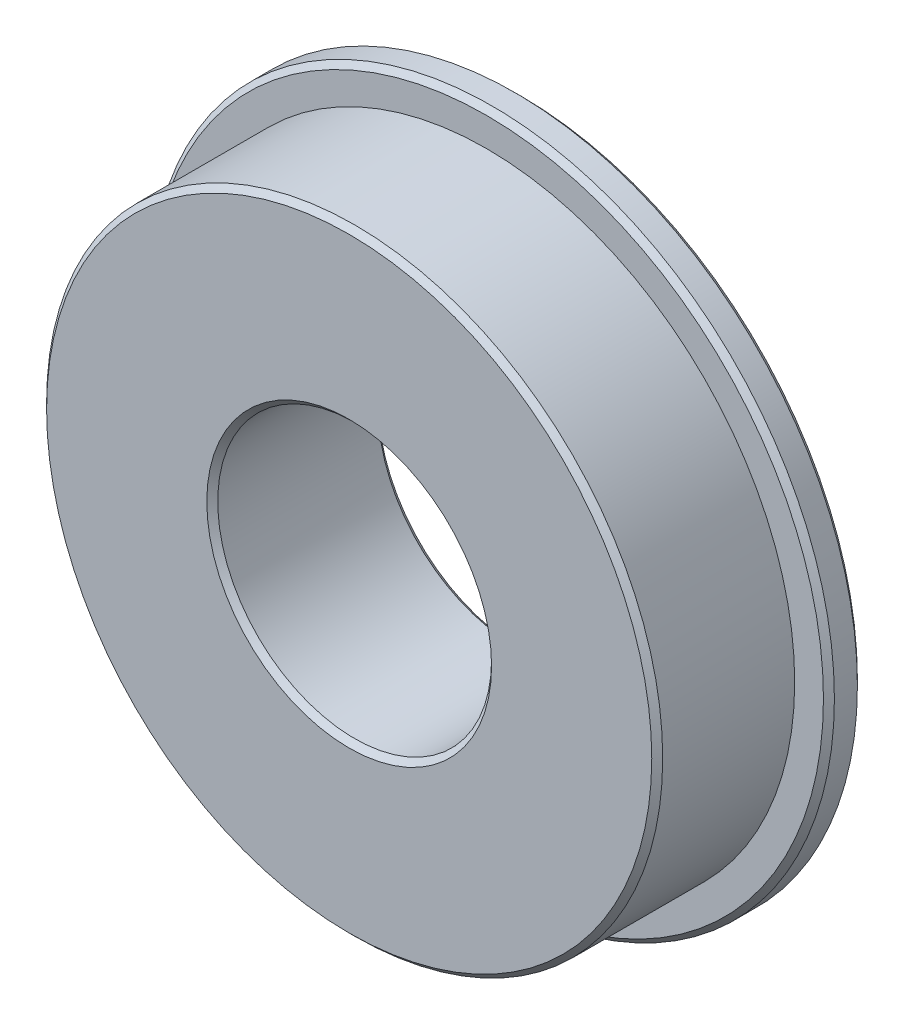
ISO-10303-21;
HEADER;
FILE_DESCRIPTION(('STEP AP214'),'2;1');
FILE_NAME('part.step','',(''),(''),'','','');
FILE_SCHEMA(('AUTOMOTIVE_DESIGN { 1 0 10303 214 1 1 1 1 }'));
ENDSEC;
DATA;
#1=APPLICATION_CONTEXT('core data for automotive mechanical design processes');
#2=APPLICATION_PROTOCOL_DEFINITION('international standard','automotive_design',2000,#1);
#3=PRODUCT_CONTEXT('',#1,'mechanical');
#4=PRODUCT('Part','Part','',(#3));
#5=PRODUCT_RELATED_PRODUCT_CATEGORY('part','',(#4));
#6=PRODUCT_DEFINITION_FORMATION('','',#4);
#7=PRODUCT_DEFINITION_CONTEXT('part definition',#1,'design');
#8=PRODUCT_DEFINITION('design','',#6,#7);
#9=PRODUCT_DEFINITION_SHAPE('','',#8);
#10=(LENGTH_UNIT() NAMED_UNIT(*) SI_UNIT(.MILLI.,.METRE.));
#11=(NAMED_UNIT(*) PLANE_ANGLE_UNIT() SI_UNIT($,.RADIAN.));
#12=(NAMED_UNIT(*) SI_UNIT($,.STERADIAN.) SOLID_ANGLE_UNIT());
#13=UNCERTAINTY_MEASURE_WITH_UNIT(LENGTH_MEASURE(1.E-05),#10,'distance_accuracy_value','');
#14=(GEOMETRIC_REPRESENTATION_CONTEXT(3) GLOBAL_UNCERTAINTY_ASSIGNED_CONTEXT((#13)) GLOBAL_UNIT_ASSIGNED_CONTEXT((#10,
#11,#12)) REPRESENTATION_CONTEXT('',''));
#15=CARTESIAN_POINT('',(0.,0.,0.));
#16=DIRECTION('',(0.,0.,1.));
#17=DIRECTION('',(1.,0.,0.));
#18=AXIS2_PLACEMENT_3D('',#15,#16,#17);
#19=CARTESIAN_POINT('',(-8.86153846153846,6.04195804195805,7.69619999999998));
#20=DIRECTION('',(0.,0.,-1.));
#21=DIRECTION('',(-1.,0.,0.));
#22=AXIS2_PLACEMENT_3D('',#19,#20,#21);
#23=CONICAL_SURFACE('',#22,14.2875,0.785398163397453);
#24=CARTESIAN_POINT('',(-8.86153846153846,6.04195804195805,7.95019999999999));
#25=DIRECTION('',(0.,0.,-1.));
#26=DIRECTION('',(-1.,0.,0.));
#27=AXIS2_PLACEMENT_3D('',#24,#25,#26);
#28=CIRCLE('',#27,14.0335);
#29=CARTESIAN_POINT('',(-22.8950384615385,6.04195804195805,7.95019999999999));
#30=VERTEX_POINT('',#29);
#31=EDGE_CURVE('E17',#30,#30,#28,.T.);
#32=ORIENTED_EDGE('',*,*,#31,.T.);
#33=EDGE_LOOP('',(#32));
#34=FACE_BOUND('',#33,.T.);
#35=CARTESIAN_POINT('',(-8.86153846153846,6.04195804195805,7.69619999999999));
#36=DIRECTION('',(0.,0.,1.));
#37=DIRECTION('',(1.,0.,0.));
#38=AXIS2_PLACEMENT_3D('',#35,#36,#37);
#39=CIRCLE('',#38,14.2875);
#40=CARTESIAN_POINT('',(5.42596153846154,6.04195804195805,7.69619999999999));
#41=VERTEX_POINT('',#40);
#42=EDGE_CURVE('E29',#41,#41,#39,.F.);
#43=ORIENTED_EDGE('',*,*,#42,.F.);
#44=EDGE_LOOP('',(#43));
#45=FACE_BOUND('',#44,.T.);
#46=ADVANCED_FACE('F14',(#34,#45),#23,.T.);
#47=CARTESIAN_POINT('',(-8.86153846153846,6.04195804195805,7.95019999999999));
#48=DIRECTION('',(0.,0.,1.));
#49=DIRECTION('',(1.,0.,0.));
#50=AXIS2_PLACEMENT_3D('',#47,#48,#49);
#51=CYLINDRICAL_SURFACE('',#50,14.2875);
#52=CARTESIAN_POINT('',(-8.86153846153846,6.04195804195805,1.57479999999999));
#53=DIRECTION('',(0.,0.,1.));
#54=DIRECTION('',(1.,0.,0.));
#55=AXIS2_PLACEMENT_3D('',#52,#53,#54);
#56=CIRCLE('',#55,14.2875);
#57=CARTESIAN_POINT('',(5.42596153846154,6.04195804195805,1.57479999999999));
#58=VERTEX_POINT('',#57);
#59=EDGE_CURVE('E38',#58,#58,#56,.T.);
#60=ORIENTED_EDGE('',*,*,#59,.T.);
#61=EDGE_LOOP('',(#60));
#62=FACE_BOUND('',#61,.T.);
#63=ORIENTED_EDGE('',*,*,#42,.T.);
#64=EDGE_LOOP('',(#63));
#65=FACE_BOUND('',#64,.T.);
#66=ADVANCED_FACE('F48',(#62,#65),#51,.T.);
#67=CARTESIAN_POINT('',(-8.86153846153846,6.04195804195805,7.95019999999999));
#68=DIRECTION('',(0.,0.,-1.));
#69=DIRECTION('',(-1.,0.,0.));
#70=AXIS2_PLACEMENT_3D('',#67,#68,#69);
#71=PLANE('',#70);
#72=ORIENTED_EDGE('',*,*,#31,.F.);
#73=EDGE_LOOP('',(#72));
#74=FACE_BOUND('',#73,.T.);
#75=CARTESIAN_POINT('',(-8.86153846153846,6.04195804195805,7.95019999998203));
#76=DIRECTION('',(0.,0.,1.));
#77=DIRECTION('',(1.,0.,0.));
#78=AXIS2_PLACEMENT_3D('',#75,#76,#77);
#79=CIRCLE('',#78,6.60399999993232);
#80=CARTESIAN_POINT('',(-2.25753846160615,6.04195804195805,7.95019999998203));
#81=VERTEX_POINT('',#80);
#82=EDGE_CURVE('E36',#81,#81,#79,.F.);
#83=ORIENTED_EDGE('',*,*,#82,.T.);
#84=EDGE_LOOP('',(#83));
#85=FACE_BOUND('',#84,.T.);
#86=ADVANCED_FACE('F55',(#74,#85),#71,.F.);
#87=CARTESIAN_POINT('',(-8.86153846153846,6.04195804195805,1.57479999999999));
#88=DIRECTION('',(0.,0.,-1.));
#89=DIRECTION('',(-1.,0.,0.));
#90=AXIS2_PLACEMENT_3D('',#87,#88,#89);
#91=PLANE('',#90);
#92=ORIENTED_EDGE('',*,*,#59,.F.);
#93=EDGE_LOOP('',(#92));
#94=FACE_BOUND('',#93,.T.);
#95=CARTESIAN_POINT('',(-8.86153846153846,6.04195804195805,1.5748));
#96=DIRECTION('',(0.,0.,-1.));
#97=DIRECTION('',(-1.,0.,0.));
#98=AXIS2_PLACEMENT_3D('',#95,#96,#97);
#99=CIRCLE('',#98,15.621);
#100=CARTESIAN_POINT('',(-24.4825384615385,6.04195804195805,1.5748));
#101=VERTEX_POINT('',#100);
#102=EDGE_CURVE('E32',#101,#101,#99,.T.);
#103=ORIENTED_EDGE('',*,*,#102,.F.);
#104=EDGE_LOOP('',(#103));
#105=FACE_BOUND('',#104,.T.);
#106=ADVANCED_FACE('F87',(#94,#105),#91,.F.);
#107=CARTESIAN_POINT('',(-8.86153846153846,6.04195804195805,7.95019999986835));
#108=DIRECTION('',(0.,0.,1.));
#109=DIRECTION('',(1.,0.,0.));
#110=AXIS2_PLACEMENT_3D('',#107,#108,#109);
#111=CONICAL_SURFACE('',#110,6.60399999981863,0.785398163285552);
#112=CARTESIAN_POINT('',(-8.86153846153846,6.04195804195805,7.69619999999999));
#113=DIRECTION('',(0.,0.,1.));
#114=DIRECTION('',(1.,0.,0.));
#115=AXIS2_PLACEMENT_3D('',#112,#113,#114);
#116=CIRCLE('',#115,6.35);
#117=CARTESIAN_POINT('',(-2.51153846153846,6.04195804195805,7.69619999999999));
#118=VERTEX_POINT('',#117);
#119=EDGE_CURVE('E35',#118,#118,#116,.F.);
#120=ORIENTED_EDGE('',*,*,#119,.T.);
#121=EDGE_LOOP('',(#120));
#122=FACE_BOUND('',#121,.T.);
#123=ORIENTED_EDGE('',*,*,#82,.F.);
#124=EDGE_LOOP('',(#123));
#125=FACE_BOUND('',#124,.T.);
#126=ADVANCED_FACE('F83',(#122,#125),#111,.F.);
#127=CARTESIAN_POINT('',(-8.86153846153846,6.04195804195805,1.32080000000001));
#128=DIRECTION('',(0.,0.,-1.));
#129=DIRECTION('',(-1.,0.,0.));
#130=AXIS2_PLACEMENT_3D('',#127,#128,#129);
#131=CONICAL_SURFACE('',#130,15.875,0.785398163397452);
#132=CARTESIAN_POINT('',(-8.86153846153846,6.04195804195805,1.32080000000001));
#133=DIRECTION('',(0.,0.,1.));
#134=DIRECTION('',(1.,0.,0.));
#135=AXIS2_PLACEMENT_3D('',#132,#133,#134);
#136=CIRCLE('',#135,15.875);
#137=CARTESIAN_POINT('',(7.01346153846154,6.04195804195805,1.32080000000001));
#138=VERTEX_POINT('',#137);
#139=EDGE_CURVE('E173',#138,#138,#136,.F.);
#140=ORIENTED_EDGE('',*,*,#139,.F.);
#141=EDGE_LOOP('',(#140));
#142=FACE_BOUND('',#141,.T.);
#143=ORIENTED_EDGE('',*,*,#102,.T.);
#144=EDGE_LOOP('',(#143));
#145=FACE_BOUND('',#144,.T.);
#146=ADVANCED_FACE('F79',(#142,#145),#131,.T.);
#147=CARTESIAN_POINT('',(-8.86153846153846,6.04195804195805,1.57479999999999));
#148=DIRECTION('',(0.,0.,1.));
#149=DIRECTION('',(1.,0.,0.));
#150=AXIS2_PLACEMENT_3D('',#147,#148,#149);
#151=CYLINDRICAL_SURFACE('',#150,6.35);
#152=ORIENTED_EDGE('',*,*,#119,.F.);
#153=EDGE_LOOP('',(#152));
#154=FACE_BOUND('',#153,.T.);
#155=CARTESIAN_POINT('',(-8.86153846153846,6.04195804195805,0.253999999927146));
#156=DIRECTION('',(0.,0.,-1.));
#157=DIRECTION('',(-1.,0.,0.));
#158=AXIS2_PLACEMENT_3D('',#155,#156,#157);
#159=CIRCLE('',#158,6.3499999999901);
#160=CARTESIAN_POINT('',(-15.2115384615286,6.04195804195805,0.253999999927146));
#161=VERTEX_POINT('',#160);
#162=EDGE_CURVE('E175',#161,#161,#159,.T.);
#163=ORIENTED_EDGE('',*,*,#162,.T.);
#164=EDGE_LOOP('',(#163));
#165=FACE_BOUND('',#164,.T.);
#166=ADVANCED_FACE('F75',(#154,#165),#151,.F.);
#167=CARTESIAN_POINT('',(-8.86153846153846,6.04195804195805,1.57479999999999));
#168=DIRECTION('',(0.,0.,1.));
#169=DIRECTION('',(1.,0.,0.));
#170=AXIS2_PLACEMENT_3D('',#167,#168,#169);
#171=CYLINDRICAL_SURFACE('',#170,15.875);
#172=CARTESIAN_POINT('',(-8.86153846153846,6.04195804195805,0.254000000000001));
#173=DIRECTION('',(0.,0.,1.));
#174=DIRECTION('',(1.,0.,0.));
#175=AXIS2_PLACEMENT_3D('',#172,#173,#174);
#176=CIRCLE('',#175,15.875);
#177=CARTESIAN_POINT('',(7.01346153846154,6.04195804195805,0.254000000000002));
#178=VERTEX_POINT('',#177);
#179=EDGE_CURVE('E26',#178,#178,#176,.F.);
#180=ORIENTED_EDGE('',*,*,#179,.F.);
#181=EDGE_LOOP('',(#180));
#182=FACE_BOUND('',#181,.T.);
#183=ORIENTED_EDGE('',*,*,#139,.T.);
#184=EDGE_LOOP('',(#183));
#185=FACE_BOUND('',#184,.T.);
#186=ADVANCED_FACE('F71',(#182,#185),#171,.T.);
#187=CARTESIAN_POINT('',(-8.86153846153846,6.04195804195805,-5.6843418860808E-11));
#188=DIRECTION('',(0.,0.,-1.));
#189=DIRECTION('',(-1.,0.,0.));
#190=AXIS2_PLACEMENT_3D('',#187,#188,#189);
#191=CONICAL_SURFACE('',#190,6.60399999997409,0.785398163397448);
#192=ORIENTED_EDGE('',*,*,#162,.F.);
#193=EDGE_LOOP('',(#192));
#194=FACE_BOUND('',#193,.T.);
#195=CARTESIAN_POINT('',(-8.86153846153846,6.04195804195805,-5.6843418860808E-11));
#196=DIRECTION('',(0.,0.,-1.));
#197=DIRECTION('',(-1.,0.,0.));
#198=AXIS2_PLACEMENT_3D('',#195,#196,#197);
#199=CIRCLE('',#198,6.60399999997409);
#200=CARTESIAN_POINT('',(-15.4655384615126,6.04195804195805,-5.6843418860808E-11));
#201=VERTEX_POINT('',#200);
#202=EDGE_CURVE('E21',#201,#201,#199,.F.);
#203=ORIENTED_EDGE('',*,*,#202,.F.);
#204=EDGE_LOOP('',(#203));
#205=FACE_BOUND('',#204,.T.);
#206=ADVANCED_FACE('F64',(#194,#205),#191,.F.);
#207=CARTESIAN_POINT('',(-8.86153846153846,6.04195804195805,0.254000000000001));
#208=DIRECTION('',(0.,0.,1.));
#209=DIRECTION('',(1.,0.,0.));
#210=AXIS2_PLACEMENT_3D('',#207,#208,#209);
#211=CONICAL_SURFACE('',#210,15.875,0.785398163397447);
#212=ORIENTED_EDGE('',*,*,#179,.T.);
#213=EDGE_LOOP('',(#212));
#214=FACE_BOUND('',#213,.T.);
#215=CARTESIAN_POINT('',(-8.86153846153846,6.04195804195805,0.));
#216=DIRECTION('',(0.,0.,1.));
#217=DIRECTION('',(1.,0.,0.));
#218=AXIS2_PLACEMENT_3D('',#215,#216,#217);
#219=CIRCLE('',#218,15.621);
#220=CARTESIAN_POINT('',(6.75946153846154,6.04195804195805,0.));
#221=VERTEX_POINT('',#220);
#222=EDGE_CURVE('E10',#221,#221,#219,.F.);
#223=ORIENTED_EDGE('',*,*,#222,.F.);
#224=EDGE_LOOP('',(#223));
#225=FACE_BOUND('',#224,.T.);
#226=ADVANCED_FACE('F58',(#214,#225),#211,.T.);
#227=CARTESIAN_POINT('',(-8.86153846153846,6.04195804195805,0.));
#228=DIRECTION('',(0.,0.,-1.));
#229=DIRECTION('',(-1.,0.,0.));
#230=AXIS2_PLACEMENT_3D('',#227,#228,#229);
#231=PLANE('',#230);
#232=ORIENTED_EDGE('',*,*,#222,.T.);
#233=EDGE_LOOP('',(#232));
#234=FACE_BOUND('',#233,.T.);
#235=ORIENTED_EDGE('',*,*,#202,.T.);
#236=EDGE_LOOP('',(#235));
#237=FACE_BOUND('',#236,.T.);
#238=ADVANCED_FACE('F56',(#234,#237),#231,.T.);
#239=CLOSED_SHELL('',(#46,#66,#86,#106,#126,#146,#166,#186,#206,#226,#238));
#240=MANIFOLD_SOLID_BREP('B1',#239);
#241=ADVANCED_BREP_SHAPE_REPRESENTATION('',(#18,#240),#14);
#242=SHAPE_DEFINITION_REPRESENTATION(#9,#241);
ENDSEC;
END-ISO-10303-21;
